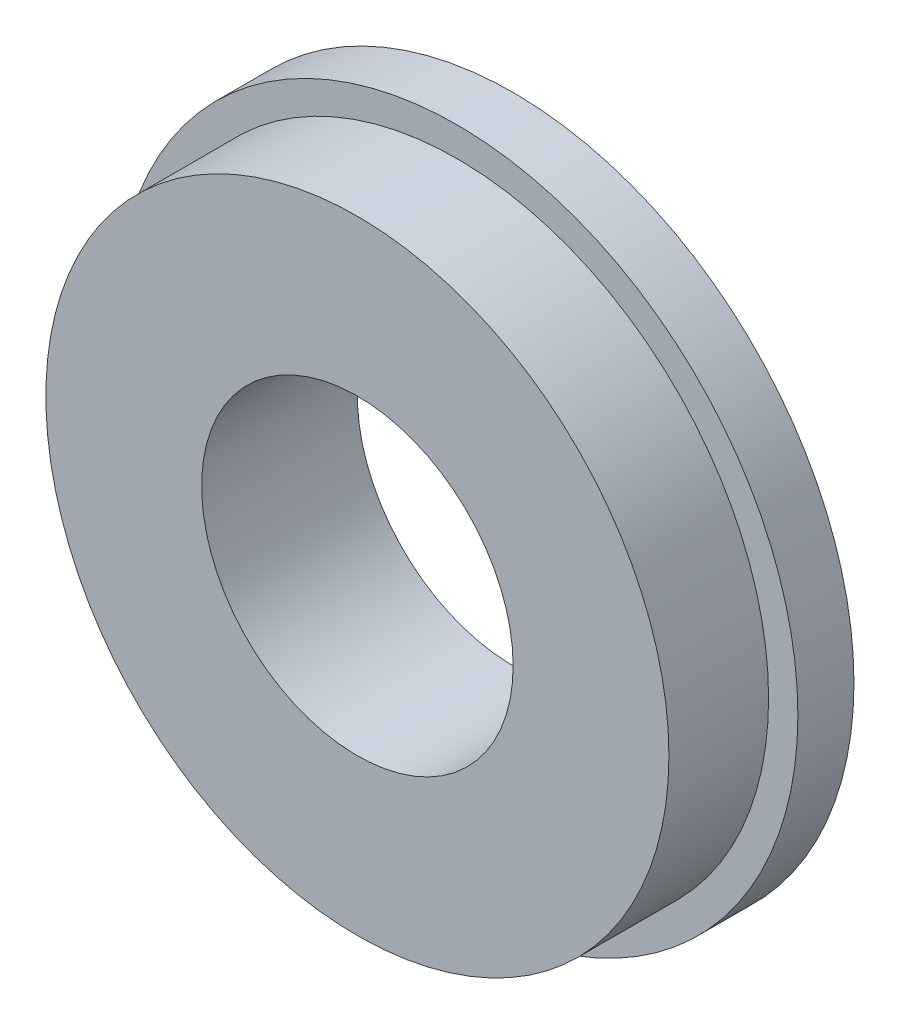
ISO-10303-21;
HEADER;
FILE_DESCRIPTION(('STEP AP214'),'2;1');
FILE_NAME('part.step','',(''),(''),'','','');
FILE_SCHEMA(('AUTOMOTIVE_DESIGN { 1 0 10303 214 1 1 1 1 }'));
ENDSEC;
DATA;
#1=APPLICATION_CONTEXT('core data for automotive mechanical design processes');
#2=APPLICATION_PROTOCOL_DEFINITION('international standard','automotive_design',2000,#1);
#3=PRODUCT_CONTEXT('',#1,'mechanical');
#4=PRODUCT('Part','Part','',(#3));
#5=PRODUCT_RELATED_PRODUCT_CATEGORY('part','',(#4));
#6=PRODUCT_DEFINITION_FORMATION('','',#4);
#7=PRODUCT_DEFINITION_CONTEXT('part definition',#1,'design');
#8=PRODUCT_DEFINITION('design','',#6,#7);
#9=PRODUCT_DEFINITION_SHAPE('','',#8);
#10=(LENGTH_UNIT() NAMED_UNIT(*) SI_UNIT(.MILLI.,.METRE.));
#11=(NAMED_UNIT(*) PLANE_ANGLE_UNIT() SI_UNIT($,.RADIAN.));
#12=(NAMED_UNIT(*) SI_UNIT($,.STERADIAN.) SOLID_ANGLE_UNIT());
#13=UNCERTAINTY_MEASURE_WITH_UNIT(LENGTH_MEASURE(1.E-05),#10,'distance_accuracy_value','');
#14=(GEOMETRIC_REPRESENTATION_CONTEXT(3) GLOBAL_UNCERTAINTY_ASSIGNED_CONTEXT((#13)) GLOBAL_UNIT_ASSIGNED_CONTEXT((#10,
#11,#12)) REPRESENTATION_CONTEXT('',''));
#15=CARTESIAN_POINT('',(0.,0.,0.));
#16=DIRECTION('',(0.,0.,1.));
#17=DIRECTION('',(1.,0.,0.));
#18=AXIS2_PLACEMENT_3D('',#15,#16,#17);
#19=CARTESIAN_POINT('',(0.,0.,54.00675));
#20=DIRECTION('',(0.,0.,1.));
#21=DIRECTION('',(1.,0.,0.));
#22=AXIS2_PLACEMENT_3D('',#19,#20,#21);
#23=CYLINDRICAL_SURFACE('',#22,6.35);
#24=CARTESIAN_POINT('',(0.,0.,1.5875));
#25=DIRECTION('',(0.,0.,1.));
#26=DIRECTION('',(1.,0.,0.));
#27=AXIS2_PLACEMENT_3D('',#24,#25,#26);
#28=CIRCLE('',#27,6.35);
#29=CARTESIAN_POINT('',(6.35,0.,1.5875));
#30=VERTEX_POINT('',#29);
#31=EDGE_CURVE('E18',#30,#30,#28,.F.);
#32=ORIENTED_EDGE('',*,*,#31,.T.);
#33=EDGE_LOOP('',(#32));
#34=FACE_BOUND('',#33,.T.);
#35=CARTESIAN_POINT('',(0.,0.,-0.4445));
#36=DIRECTION('',(0.,0.,1.));
#37=DIRECTION('',(1.,0.,0.));
#38=AXIS2_PLACEMENT_3D('',#35,#36,#37);
#39=CIRCLE('',#38,6.35);
#40=CARTESIAN_POINT('',(6.35,0.,-0.4445));
#41=VERTEX_POINT('',#40);
#42=EDGE_CURVE('E34',#41,#41,#39,.T.);
#43=ORIENTED_EDGE('',*,*,#42,.T.);
#44=EDGE_LOOP('',(#43));
#45=FACE_BOUND('',#44,.T.);
#46=ADVANCED_FACE('F15',(#34,#45),#23,.T.);
#47=CARTESIAN_POINT('',(-3.175,0.,1.5875));
#48=DIRECTION('',(0.,0.,-1.));
#49=DIRECTION('',(-1.,0.,0.));
#50=AXIS2_PLACEMENT_3D('',#47,#48,#49);
#51=PLANE('',#50);
#52=CARTESIAN_POINT('',(0.,0.,1.5875));
#53=DIRECTION('',(0.,0.,1.));
#54=DIRECTION('',(1.,0.,0.));
#55=AXIS2_PLACEMENT_3D('',#52,#53,#54);
#56=CIRCLE('',#55,3.175);
#57=CARTESIAN_POINT('',(3.175,0.,1.5875));
#58=VERTEX_POINT('',#57);
#59=EDGE_CURVE('E32',#58,#58,#56,.F.);
#60=ORIENTED_EDGE('',*,*,#59,.T.);
#61=EDGE_LOOP('',(#60));
#62=FACE_BOUND('',#61,.T.);
#63=ORIENTED_EDGE('',*,*,#31,.F.);
#64=EDGE_LOOP('',(#63));
#65=FACE_BOUND('',#64,.T.);
#66=ADVANCED_FACE('F42',(#62,#65),#51,.F.);
#67=CARTESIAN_POINT('',(-6.35,0.,-0.4445));
#68=DIRECTION('',(0.,0.,-1.));
#69=DIRECTION('',(-1.,0.,0.));
#70=AXIS2_PLACEMENT_3D('',#67,#68,#69);
#71=PLANE('',#70);
#72=ORIENTED_EDGE('',*,*,#42,.F.);
#73=EDGE_LOOP('',(#72));
#74=FACE_BOUND('',#73,.T.);
#75=CARTESIAN_POINT('',(0.,0.,-0.4445));
#76=DIRECTION('',(0.,0.,1.));
#77=DIRECTION('',(1.,0.,0.));
#78=AXIS2_PLACEMENT_3D('',#75,#76,#77);
#79=CIRCLE('',#78,6.9469);
#80=CARTESIAN_POINT('',(6.9469,0.,-0.4445));
#81=VERTEX_POINT('',#80);
#82=EDGE_CURVE('E27',#81,#81,#79,.F.);
#83=ORIENTED_EDGE('',*,*,#82,.F.);
#84=EDGE_LOOP('',(#83));
#85=FACE_BOUND('',#84,.T.);
#86=ADVANCED_FACE('F44',(#74,#85),#71,.F.);
#87=CARTESIAN_POINT('',(0.,0.,54.00675));
#88=DIRECTION('',(0.,0.,1.));
#89=DIRECTION('',(1.,0.,0.));
#90=AXIS2_PLACEMENT_3D('',#87,#88,#89);
#91=CYLINDRICAL_SURFACE('',#90,3.175);
#92=CARTESIAN_POINT('',(0.,0.,-1.5875));
#93=DIRECTION('',(0.,0.,1.));
#94=DIRECTION('',(1.,0.,0.));
#95=AXIS2_PLACEMENT_3D('',#92,#93,#94);
#96=CIRCLE('',#95,3.175);
#97=CARTESIAN_POINT('',(3.175,0.,-1.5875));
#98=VERTEX_POINT('',#97);
#99=EDGE_CURVE('E22',#98,#98,#96,.F.);
#100=ORIENTED_EDGE('',*,*,#99,.T.);
#101=EDGE_LOOP('',(#100));
#102=FACE_BOUND('',#101,.T.);
#103=ORIENTED_EDGE('',*,*,#59,.F.);
#104=EDGE_LOOP('',(#103));
#105=FACE_BOUND('',#104,.T.);
#106=ADVANCED_FACE('F51',(#102,#105),#91,.F.);
#107=CARTESIAN_POINT('',(0.,0.,54.00675));
#108=DIRECTION('',(0.,0.,1.));
#109=DIRECTION('',(1.,0.,0.));
#110=AXIS2_PLACEMENT_3D('',#107,#108,#109);
#111=CYLINDRICAL_SURFACE('',#110,6.9469);
#112=ORIENTED_EDGE('',*,*,#82,.T.);
#113=EDGE_LOOP('',(#112));
#114=FACE_BOUND('',#113,.T.);
#115=CARTESIAN_POINT('',(0.,0.,-1.5875));
#116=DIRECTION('',(0.,0.,1.));
#117=DIRECTION('',(1.,0.,0.));
#118=AXIS2_PLACEMENT_3D('',#115,#116,#117);
#119=CIRCLE('',#118,6.9469);
#120=CARTESIAN_POINT('',(6.9469,0.,-1.5875));
#121=VERTEX_POINT('',#120);
#122=EDGE_CURVE('E10',#121,#121,#119,.T.);
#123=ORIENTED_EDGE('',*,*,#122,.T.);
#124=EDGE_LOOP('',(#123));
#125=FACE_BOUND('',#124,.T.);
#126=ADVANCED_FACE('F56',(#114,#125),#111,.T.);
#127=CARTESIAN_POINT('',(-6.9469,0.,-1.5875));
#128=DIRECTION('',(0.,0.,1.));
#129=DIRECTION('',(1.,0.,0.));
#130=AXIS2_PLACEMENT_3D('',#127,#128,#129);
#131=PLANE('',#130);
#132=ORIENTED_EDGE('',*,*,#122,.F.);
#133=EDGE_LOOP('',(#132));
#134=FACE_BOUND('',#133,.T.);
#135=ORIENTED_EDGE('',*,*,#99,.F.);
#136=EDGE_LOOP('',(#135));
#137=FACE_BOUND('',#136,.T.);
#138=ADVANCED_FACE('F54',(#134,#137),#131,.F.);
#139=CLOSED_SHELL('',(#46,#66,#86,#106,#126,#138));
#140=MANIFOLD_SOLID_BREP('B1',#139);
#141=ADVANCED_BREP_SHAPE_REPRESENTATION('',(#18,#140),#14);
#142=SHAPE_DEFINITION_REPRESENTATION(#9,#141);
ENDSEC;
END-ISO-10303-21;
